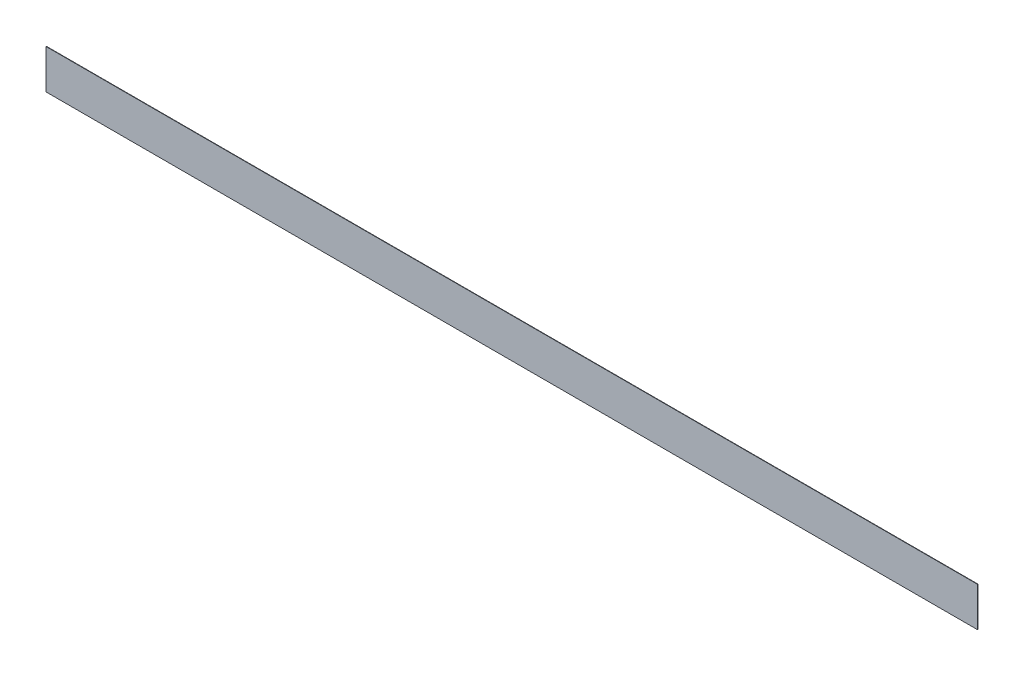
ISO-10303-21;
HEADER;
FILE_DESCRIPTION(('STEP AP214'),'2;1');
FILE_NAME('part.step','',(''),(''),'','','');
FILE_SCHEMA(('AUTOMOTIVE_DESIGN { 1 0 10303 214 1 1 1 1 }'));
ENDSEC;
DATA;
#1=APPLICATION_CONTEXT('core data for automotive mechanical design processes');
#2=APPLICATION_PROTOCOL_DEFINITION('international standard','automotive_design',2000,#1);
#3=PRODUCT_CONTEXT('',#1,'mechanical');
#4=PRODUCT('Part','Part','',(#3));
#5=PRODUCT_RELATED_PRODUCT_CATEGORY('part','',(#4));
#6=PRODUCT_DEFINITION_FORMATION('','',#4);
#7=PRODUCT_DEFINITION_CONTEXT('part definition',#1,'design');
#8=PRODUCT_DEFINITION('design','',#6,#7);
#9=PRODUCT_DEFINITION_SHAPE('','',#8);
#10=(LENGTH_UNIT() NAMED_UNIT(*) SI_UNIT(.MILLI.,.METRE.));
#11=(NAMED_UNIT(*) PLANE_ANGLE_UNIT() SI_UNIT($,.RADIAN.));
#12=(NAMED_UNIT(*) SI_UNIT($,.STERADIAN.) SOLID_ANGLE_UNIT());
#13=UNCERTAINTY_MEASURE_WITH_UNIT(LENGTH_MEASURE(1.E-05),#10,'distance_accuracy_value','');
#14=(GEOMETRIC_REPRESENTATION_CONTEXT(3) GLOBAL_UNCERTAINTY_ASSIGNED_CONTEXT((#13)) GLOBAL_UNIT_ASSIGNED_CONTEXT((#10,
#11,#12)) REPRESENTATION_CONTEXT('',''));
#15=CARTESIAN_POINT('',(0.,0.,0.));
#16=DIRECTION('',(0.,0.,1.));
#17=DIRECTION('',(1.,0.,0.));
#18=AXIS2_PLACEMENT_3D('',#15,#16,#17);
#19=CARTESIAN_POINT('',(0.,0.,0.));
#20=DIRECTION('',(0.,0.,1.));
#21=DIRECTION('',(1.,0.,0.));
#22=AXIS2_PLACEMENT_3D('',#19,#20,#21);
#23=PLANE('',#22);
#24=DIRECTION('',(1.,0.,0.));
#25=VECTOR('',#24,1.);
#26=CARTESIAN_POINT('',(300.6725,12.7,0.));
#27=LINE('',#26,#25);
#28=CARTESIAN_POINT('',(-300.6725,12.7,0.));
#29=VERTEX_POINT('',#28);
#30=CARTESIAN_POINT('',(300.6725,12.7,0.));
#31=VERTEX_POINT('',#30);
#32=EDGE_CURVE('E81',#29,#31,#27,.T.);
#33=ORIENTED_EDGE('',*,*,#32,.T.);
#34=DIRECTION('',(0.,1.,0.));
#35=VECTOR('',#34,1.);
#36=CARTESIAN_POINT('',(300.6725,-12.7,0.));
#37=LINE('',#36,#35);
#38=CARTESIAN_POINT('',(300.6725,-12.7,0.));
#39=VERTEX_POINT('',#38);
#40=EDGE_CURVE('E68',#31,#39,#37,.F.);
#41=ORIENTED_EDGE('',*,*,#40,.T.);
#42=DIRECTION('',(-1.,0.,0.));
#43=VECTOR('',#42,1.);
#44=CARTESIAN_POINT('',(300.6725,-12.7,0.));
#45=LINE('',#44,#43);
#46=CARTESIAN_POINT('',(-300.6725,-12.7,0.));
#47=VERTEX_POINT('',#46);
#48=EDGE_CURVE('E55',#39,#47,#45,.T.);
#49=ORIENTED_EDGE('',*,*,#48,.T.);
#50=DIRECTION('',(0.,1.,0.));
#51=VECTOR('',#50,1.);
#52=CARTESIAN_POINT('',(-300.6725,-12.7,0.));
#53=LINE('',#52,#51);
#54=EDGE_CURVE('E20',#47,#29,#53,.T.);
#55=ORIENTED_EDGE('',*,*,#54,.T.);
#56=EDGE_LOOP('',(#33,#41,#49,#55));
#57=FACE_BOUND('',#56,.T.);
#58=ADVANCED_FACE('F17',(#57),#23,.F.);
#59=CARTESIAN_POINT('',(-300.6725,-12.7,0.254));
#60=DIRECTION('',(1.,0.,0.));
#61=DIRECTION('',(0.,0.,-1.));
#62=AXIS2_PLACEMENT_3D('',#59,#60,#61);
#63=PLANE('',#62);
#64=DIRECTION('',(0.,0.,1.));
#65=VECTOR('',#64,1.);
#66=CARTESIAN_POINT('',(-300.6725,-12.7,0.254));
#67=LINE('',#66,#65);
#68=CARTESIAN_POINT('',(-300.6725,-12.7,0.254));
#69=VERTEX_POINT('',#68);
#70=EDGE_CURVE('E61',#47,#69,#67,.T.);
#71=ORIENTED_EDGE('',*,*,#70,.T.);
#72=DIRECTION('',(0.,1.,0.));
#73=VECTOR('',#72,1.);
#74=CARTESIAN_POINT('',(-300.6725,0.,0.254));
#75=LINE('',#74,#73);
#76=CARTESIAN_POINT('',(-300.6725,12.7,0.254));
#77=VERTEX_POINT('',#76);
#78=EDGE_CURVE('E83',#77,#69,#75,.F.);
#79=ORIENTED_EDGE('',*,*,#78,.F.);
#80=DIRECTION('',(0.,0.,1.));
#81=VECTOR('',#80,1.);
#82=CARTESIAN_POINT('',(-300.6725,12.7,0.254));
#83=LINE('',#82,#81);
#84=EDGE_CURVE('E64',#77,#29,#83,.F.);
#85=ORIENTED_EDGE('',*,*,#84,.T.);
#86=ORIENTED_EDGE('',*,*,#54,.F.);
#87=EDGE_LOOP('',(#71,#79,#85,#86));
#88=FACE_BOUND('',#87,.T.);
#89=ADVANCED_FACE('F60',(#88),#63,.F.);
#90=CARTESIAN_POINT('',(300.6725,-12.7,0.254));
#91=DIRECTION('',(0.,1.,0.));
#92=DIRECTION('',(-1.,0.,0.));
#93=AXIS2_PLACEMENT_3D('',#90,#91,#92);
#94=PLANE('',#93);
#95=DIRECTION('',(0.,0.,1.));
#96=VECTOR('',#95,1.);
#97=CARTESIAN_POINT('',(300.6725,-12.7,0.254));
#98=LINE('',#97,#96);
#99=CARTESIAN_POINT('',(300.6725,-12.7,0.254));
#100=VERTEX_POINT('',#99);
#101=EDGE_CURVE('E70',#39,#100,#98,.T.);
#102=ORIENTED_EDGE('',*,*,#101,.T.);
#103=DIRECTION('',(1.,0.,0.));
#104=VECTOR('',#103,1.);
#105=CARTESIAN_POINT('',(0.,-12.7,0.254));
#106=LINE('',#105,#104);
#107=EDGE_CURVE('E74',#69,#100,#106,.T.);
#108=ORIENTED_EDGE('',*,*,#107,.F.);
#109=ORIENTED_EDGE('',*,*,#70,.F.);
#110=ORIENTED_EDGE('',*,*,#48,.F.);
#111=EDGE_LOOP('',(#102,#108,#109,#110));
#112=FACE_BOUND('',#111,.T.);
#113=ADVANCED_FACE('F72',(#112),#94,.F.);
#114=CARTESIAN_POINT('',(300.6725,-12.7,0.254));
#115=DIRECTION('',(-1.,0.,0.));
#116=DIRECTION('',(0.,0.,1.));
#117=AXIS2_PLACEMENT_3D('',#114,#115,#116);
#118=PLANE('',#117);
#119=DIRECTION('',(0.,0.,1.));
#120=VECTOR('',#119,1.);
#121=CARTESIAN_POINT('',(300.6725,12.7,0.254));
#122=LINE('',#121,#120);
#123=CARTESIAN_POINT('',(300.6725,12.7,0.254));
#124=VERTEX_POINT('',#123);
#125=EDGE_CURVE('E35',#31,#124,#122,.T.);
#126=ORIENTED_EDGE('',*,*,#125,.T.);
#127=DIRECTION('',(0.,1.,0.));
#128=VECTOR('',#127,1.);
#129=CARTESIAN_POINT('',(300.6725,0.,0.254));
#130=LINE('',#129,#128);
#131=EDGE_CURVE('E26',#100,#124,#130,.T.);
#132=ORIENTED_EDGE('',*,*,#131,.F.);
#133=ORIENTED_EDGE('',*,*,#101,.F.);
#134=ORIENTED_EDGE('',*,*,#40,.F.);
#135=EDGE_LOOP('',(#126,#132,#133,#134));
#136=FACE_BOUND('',#135,.T.);
#137=ADVANCED_FACE('F89',(#136),#118,.F.);
#138=CARTESIAN_POINT('',(300.6725,12.7,0.254));
#139=DIRECTION('',(0.,-1.,0.));
#140=DIRECTION('',(1.,0.,0.));
#141=AXIS2_PLACEMENT_3D('',#138,#139,#140);
#142=PLANE('',#141);
#143=ORIENTED_EDGE('',*,*,#84,.F.);
#144=DIRECTION('',(1.,0.,0.));
#145=VECTOR('',#144,1.);
#146=CARTESIAN_POINT('',(0.,12.7,0.254));
#147=LINE('',#146,#145);
#148=EDGE_CURVE('E11',#124,#77,#147,.F.);
#149=ORIENTED_EDGE('',*,*,#148,.F.);
#150=ORIENTED_EDGE('',*,*,#125,.F.);
#151=ORIENTED_EDGE('',*,*,#32,.F.);
#152=EDGE_LOOP('',(#143,#149,#150,#151));
#153=FACE_BOUND('',#152,.T.);
#154=ADVANCED_FACE('F91',(#153),#142,.F.);
#155=CARTESIAN_POINT('',(0.,0.,0.254));
#156=DIRECTION('',(0.,0.,1.));
#157=DIRECTION('',(1.,0.,0.));
#158=AXIS2_PLACEMENT_3D('',#155,#156,#157);
#159=PLANE('',#158);
#160=ORIENTED_EDGE('',*,*,#131,.T.);
#161=ORIENTED_EDGE('',*,*,#148,.T.);
#162=ORIENTED_EDGE('',*,*,#78,.T.);
#163=ORIENTED_EDGE('',*,*,#107,.T.);
#164=EDGE_LOOP('',(#160,#161,#162,#163));
#165=FACE_BOUND('',#164,.T.);
#166=ADVANCED_FACE('F88',(#165),#159,.T.);
#167=CLOSED_SHELL('',(#58,#89,#113,#137,#154,#166));
#168=MANIFOLD_SOLID_BREP('B1',#167);
#169=ADVANCED_BREP_SHAPE_REPRESENTATION('',(#18,#168),#14);
#170=SHAPE_DEFINITION_REPRESENTATION(#9,#169);
ENDSEC;
END-ISO-10303-21;
